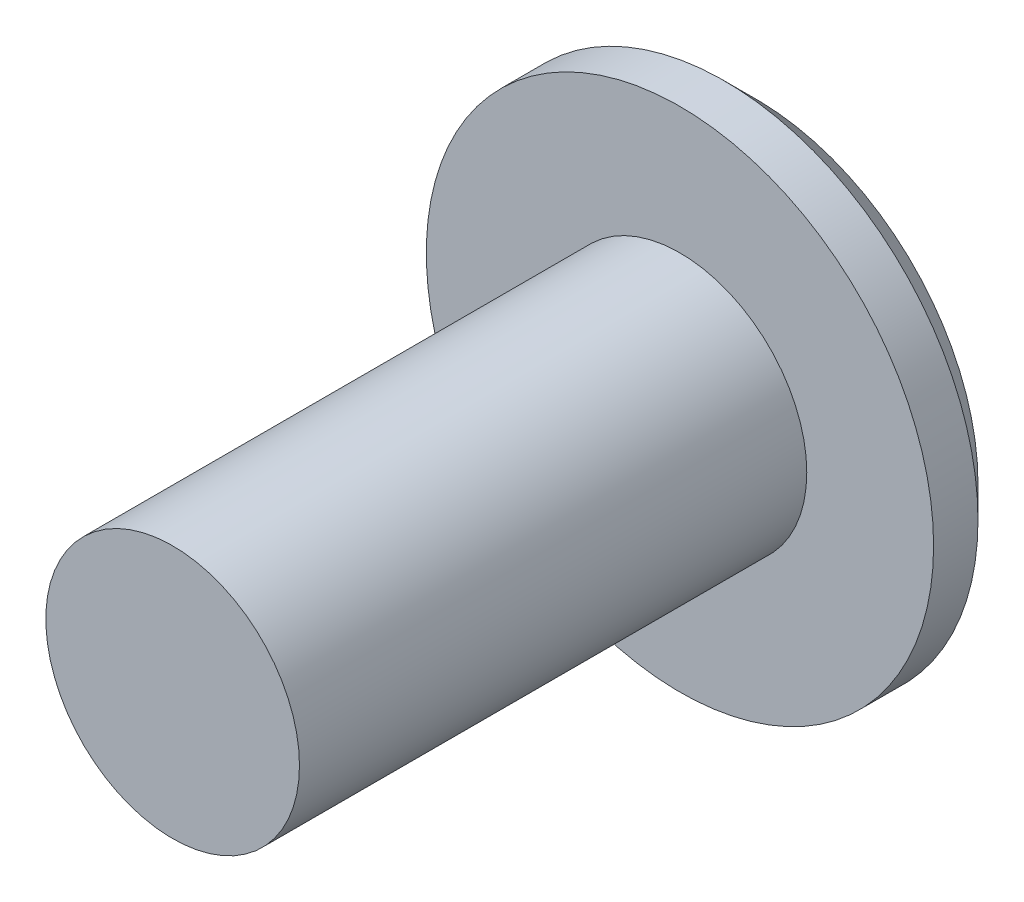
ISO-10303-21;
HEADER;
FILE_DESCRIPTION(('STEP AP214'),'2;1');
FILE_NAME('part.step','',(''),(''),'','','');
FILE_SCHEMA(('AUTOMOTIVE_DESIGN { 1 0 10303 214 1 1 1 1 }'));
ENDSEC;
DATA;
#1=APPLICATION_CONTEXT('core data for automotive mechanical design processes');
#2=APPLICATION_PROTOCOL_DEFINITION('international standard','automotive_design',2000,#1);
#3=PRODUCT_CONTEXT('',#1,'mechanical');
#4=PRODUCT('Part','Part','',(#3));
#5=PRODUCT_RELATED_PRODUCT_CATEGORY('part','',(#4));
#6=PRODUCT_DEFINITION_FORMATION('','',#4);
#7=PRODUCT_DEFINITION_CONTEXT('part definition',#1,'design');
#8=PRODUCT_DEFINITION('design','',#6,#7);
#9=PRODUCT_DEFINITION_SHAPE('','',#8);
#10=(LENGTH_UNIT() NAMED_UNIT(*) SI_UNIT(.MILLI.,.METRE.));
#11=(NAMED_UNIT(*) PLANE_ANGLE_UNIT() SI_UNIT($,.RADIAN.));
#12=(NAMED_UNIT(*) SI_UNIT($,.STERADIAN.) SOLID_ANGLE_UNIT());
#13=UNCERTAINTY_MEASURE_WITH_UNIT(LENGTH_MEASURE(1.E-05),#10,'distance_accuracy_value','');
#14=(GEOMETRIC_REPRESENTATION_CONTEXT(3) GLOBAL_UNCERTAINTY_ASSIGNED_CONTEXT((#13)) GLOBAL_UNIT_ASSIGNED_CONTEXT((#10,
#11,#12)) REPRESENTATION_CONTEXT('',''));
#15=CARTESIAN_POINT('',(0.,0.,0.));
#16=DIRECTION('',(0.,0.,1.));
#17=DIRECTION('',(1.,0.,0.));
#18=AXIS2_PLACEMENT_3D('',#15,#16,#17);
#19=CARTESIAN_POINT('',(0.,0.,1.2));
#20=DIRECTION('',(0.,0.,-1.));
#21=DIRECTION('',(-1.,0.,0.));
#22=AXIS2_PLACEMENT_3D('',#19,#20,#21);
#23=CYLINDRICAL_SURFACE('',#22,4.);
#24=CARTESIAN_POINT('',(0.,0.,0.500000000000001));
#25=DIRECTION('',(0.,0.,1.));
#26=DIRECTION('',(1.,0.,0.));
#27=AXIS2_PLACEMENT_3D('',#24,#25,#26);
#28=CIRCLE('',#27,4.);
#29=CARTESIAN_POINT('',(4.,0.,0.500000000000001));
#30=VERTEX_POINT('',#29);
#31=EDGE_CURVE('E151',#30,#30,#28,.T.);
#32=ORIENTED_EDGE('',*,*,#31,.T.);
#33=EDGE_LOOP('',(#32));
#34=FACE_BOUND('',#33,.T.);
#35=CARTESIAN_POINT('',(0.,0.,1.2));
#36=DIRECTION('',(0.,0.,1.));
#37=DIRECTION('',(1.,0.,0.));
#38=AXIS2_PLACEMENT_3D('',#35,#36,#37);
#39=CIRCLE('',#38,4.);
#40=CARTESIAN_POINT('',(4.,0.,1.2));
#41=VERTEX_POINT('',#40);
#42=EDGE_CURVE('E148',#41,#41,#39,.T.);
#43=ORIENTED_EDGE('',*,*,#42,.F.);
#44=EDGE_LOOP('',(#43));
#45=FACE_BOUND('',#44,.T.);
#46=ADVANCED_FACE('F37',(#34,#45),#23,.T.);
#47=CARTESIAN_POINT('',(0.,0.,1.2));
#48=DIRECTION('',(0.,0.,1.));
#49=DIRECTION('',(1.,0.,0.));
#50=AXIS2_PLACEMENT_3D('',#47,#48,#49);
#51=PLANE('',#50);
#52=CARTESIAN_POINT('',(0.,0.,1.2));
#53=DIRECTION('',(0.,0.,1.));
#54=DIRECTION('',(1.,0.,0.));
#55=AXIS2_PLACEMENT_3D('',#52,#53,#54);
#56=CIRCLE('',#55,2.);
#57=CARTESIAN_POINT('',(2.,0.,1.2));
#58=VERTEX_POINT('',#57);
#59=EDGE_CURVE('E11',#58,#58,#56,.T.);
#60=ORIENTED_EDGE('',*,*,#59,.F.);
#61=EDGE_LOOP('',(#60));
#62=FACE_BOUND('',#61,.T.);
#63=ORIENTED_EDGE('',*,*,#42,.T.);
#64=EDGE_LOOP('',(#63));
#65=FACE_BOUND('',#64,.T.);
#66=ADVANCED_FACE('F170',(#62,#65),#51,.T.);
#67=CARTESIAN_POINT('',(0.,0.,0.));
#68=DIRECTION('',(0.,0.,1.));
#69=DIRECTION('',(1.,0.,0.));
#70=AXIS2_PLACEMENT_3D('',#67,#68,#69);
#71=PLANE('',#70);
#72=DIRECTION('',(0.866025403784439,-0.5,0.));
#73=VECTOR('',#72,1.);
#74=CARTESIAN_POINT('',(0.,1.44337567297406,0.));
#75=LINE('',#74,#73);
#76=CARTESIAN_POINT('',(0.,1.44337567297406,0.));
#77=VERTEX_POINT('',#76);
#78=CARTESIAN_POINT('',(1.25,0.721687836487033,0.));
#79=VERTEX_POINT('',#78);
#80=EDGE_CURVE('E128',#77,#79,#75,.T.);
#81=ORIENTED_EDGE('',*,*,#80,.F.);
#82=DIRECTION('',(0.866025403784439,0.5,0.));
#83=VECTOR('',#82,1.);
#84=CARTESIAN_POINT('',(-1.25,0.721687836487033,0.));
#85=LINE('',#84,#83);
#86=CARTESIAN_POINT('',(-1.25,0.721687836487033,0.));
#87=VERTEX_POINT('',#86);
#88=EDGE_CURVE('E54',#87,#77,#85,.T.);
#89=ORIENTED_EDGE('',*,*,#88,.F.);
#90=DIRECTION('',(0.,1.,0.));
#91=VECTOR('',#90,1.);
#92=CARTESIAN_POINT('',(-1.25,-0.721687836487033,0.));
#93=LINE('',#92,#91);
#94=CARTESIAN_POINT('',(-1.25,-0.721687836487033,0.));
#95=VERTEX_POINT('',#94);
#96=EDGE_CURVE('E137',#95,#87,#93,.T.);
#97=ORIENTED_EDGE('',*,*,#96,.F.);
#98=DIRECTION('',(-0.866025403784439,0.5,0.));
#99=VECTOR('',#98,1.);
#100=CARTESIAN_POINT('',(0.,-1.44337567297406,0.));
#101=LINE('',#100,#99);
#102=CARTESIAN_POINT('',(0.,-1.44337567297406,0.));
#103=VERTEX_POINT('',#102);
#104=EDGE_CURVE('E135',#103,#95,#101,.T.);
#105=ORIENTED_EDGE('',*,*,#104,.F.);
#106=DIRECTION('',(-0.866025403784439,-0.5,0.));
#107=VECTOR('',#106,1.);
#108=CARTESIAN_POINT('',(1.25,-0.721687836487032,0.));
#109=LINE('',#108,#107);
#110=CARTESIAN_POINT('',(1.25,-0.721687836487032,0.));
#111=VERTEX_POINT('',#110);
#112=EDGE_CURVE('E102',#111,#103,#109,.T.);
#113=ORIENTED_EDGE('',*,*,#112,.F.);
#114=DIRECTION('',(0.,-1.,0.));
#115=VECTOR('',#114,1.);
#116=CARTESIAN_POINT('',(1.25,0.721687836487033,0.));
#117=LINE('',#116,#115);
#118=EDGE_CURVE('E131',#79,#111,#117,.T.);
#119=ORIENTED_EDGE('',*,*,#118,.F.);
#120=EDGE_LOOP('',(#81,#89,#97,#105,#113,#119));
#121=FACE_BOUND('',#120,.T.);
#122=CARTESIAN_POINT('',(0.,0.,0.));
#123=DIRECTION('',(0.,0.,1.));
#124=DIRECTION('',(1.,0.,0.));
#125=AXIS2_PLACEMENT_3D('',#122,#123,#124);
#126=CIRCLE('',#125,3.5);
#127=CARTESIAN_POINT('',(3.5,0.,0.));
#128=VERTEX_POINT('',#127);
#129=EDGE_CURVE('E42',#128,#128,#126,.F.);
#130=ORIENTED_EDGE('',*,*,#129,.T.);
#131=EDGE_LOOP('',(#130));
#132=FACE_BOUND('',#131,.T.);
#133=ADVANCED_FACE('F158',(#121,#132),#71,.F.);
#134=CARTESIAN_POINT('',(0.,0.,0.500000000000001));
#135=DIRECTION('',(0.,0.,1.));
#136=DIRECTION('',(1.,0.,0.));
#137=AXIS2_PLACEMENT_3D('',#134,#135,#136);
#138=CONICAL_SURFACE('',#137,4.,0.78539816339745);
#139=ORIENTED_EDGE('',*,*,#129,.F.);
#140=EDGE_LOOP('',(#139));
#141=FACE_BOUND('',#140,.T.);
#142=ORIENTED_EDGE('',*,*,#31,.F.);
#143=EDGE_LOOP('',(#142));
#144=FACE_BOUND('',#143,.T.);
#145=ADVANCED_FACE('F40',(#141,#144),#138,.T.);
#146=CARTESIAN_POINT('',(0.,0.,9.2));
#147=DIRECTION('',(0.,0.,-1.));
#148=DIRECTION('',(-1.,0.,0.));
#149=AXIS2_PLACEMENT_3D('',#146,#147,#148);
#150=CYLINDRICAL_SURFACE('',#149,2.);
#151=CARTESIAN_POINT('',(0.,0.,9.2));
#152=DIRECTION('',(0.,0.,1.));
#153=DIRECTION('',(1.,0.,0.));
#154=AXIS2_PLACEMENT_3D('',#151,#152,#153);
#155=CIRCLE('',#154,2.);
#156=CARTESIAN_POINT('',(2.,0.,9.2));
#157=VERTEX_POINT('',#156);
#158=EDGE_CURVE('E141',#157,#157,#155,.T.);
#159=ORIENTED_EDGE('',*,*,#158,.F.);
#160=EDGE_LOOP('',(#159));
#161=FACE_BOUND('',#160,.T.);
#162=ORIENTED_EDGE('',*,*,#59,.T.);
#163=EDGE_LOOP('',(#162));
#164=FACE_BOUND('',#163,.T.);
#165=ADVANCED_FACE('F162',(#161,#164),#150,.T.);
#166=CARTESIAN_POINT('',(0.,0.,9.2));
#167=DIRECTION('',(0.,0.,1.));
#168=DIRECTION('',(1.,0.,0.));
#169=AXIS2_PLACEMENT_3D('',#166,#167,#168);
#170=PLANE('',#169);
#171=ORIENTED_EDGE('',*,*,#158,.T.);
#172=EDGE_LOOP('',(#171));
#173=FACE_BOUND('',#172,.T.);
#174=ADVANCED_FACE('F167',(#173),#170,.T.);
#175=CARTESIAN_POINT('',(-1.25,0.721687836487033,2.2));
#176=DIRECTION('',(-0.5,0.866025403784439,0.));
#177=DIRECTION('',(-0.866025403784439,-0.5,0.));
#178=AXIS2_PLACEMENT_3D('',#175,#176,#177);
#179=PLANE('',#178);
#180=ORIENTED_EDGE('',*,*,#88,.T.);
#181=DIRECTION('',(0.,0.,-1.));
#182=VECTOR('',#181,1.);
#183=CARTESIAN_POINT('',(0.,1.44337567297406,2.2));
#184=LINE('',#183,#182);
#185=CARTESIAN_POINT('',(0.,1.44337567297406,2.2));
#186=VERTEX_POINT('',#185);
#187=EDGE_CURVE('E84',#186,#77,#184,.T.);
#188=ORIENTED_EDGE('',*,*,#187,.F.);
#189=DIRECTION('',(0.866025403784439,0.5,0.));
#190=VECTOR('',#189,1.);
#191=CARTESIAN_POINT('',(-1.25,0.721687836487033,2.2));
#192=LINE('',#191,#190);
#193=CARTESIAN_POINT('',(-1.25,0.721687836487033,2.2));
#194=VERTEX_POINT('',#193);
#195=EDGE_CURVE('E139',#194,#186,#192,.T.);
#196=ORIENTED_EDGE('',*,*,#195,.F.);
#197=DIRECTION('',(0.,0.,-1.));
#198=VECTOR('',#197,1.);
#199=CARTESIAN_POINT('',(-1.25,0.721687836487033,2.2));
#200=LINE('',#199,#198);
#201=EDGE_CURVE('E62',#194,#87,#200,.T.);
#202=ORIENTED_EDGE('',*,*,#201,.T.);
#203=EDGE_LOOP('',(#180,#188,#196,#202));
#204=FACE_BOUND('',#203,.T.);
#205=ADVANCED_FACE('F183',(#204),#179,.F.);
#206=CARTESIAN_POINT('',(-1.25,-0.721687836487033,2.2));
#207=DIRECTION('',(-1.,0.,0.));
#208=DIRECTION('',(0.,-1.,0.));
#209=AXIS2_PLACEMENT_3D('',#206,#207,#208);
#210=PLANE('',#209);
#211=ORIENTED_EDGE('',*,*,#96,.T.);
#212=ORIENTED_EDGE('',*,*,#201,.F.);
#213=DIRECTION('',(0.,1.,0.));
#214=VECTOR('',#213,1.);
#215=CARTESIAN_POINT('',(-1.25,-0.721687836487033,2.2));
#216=LINE('',#215,#214);
#217=CARTESIAN_POINT('',(-1.25,-0.721687836487033,2.2));
#218=VERTEX_POINT('',#217);
#219=EDGE_CURVE('E114',#218,#194,#216,.T.);
#220=ORIENTED_EDGE('',*,*,#219,.F.);
#221=DIRECTION('',(0.,0.,-1.));
#222=VECTOR('',#221,1.);
#223=CARTESIAN_POINT('',(-1.25,-0.721687836487033,2.2));
#224=LINE('',#223,#222);
#225=EDGE_CURVE('E106',#218,#95,#224,.T.);
#226=ORIENTED_EDGE('',*,*,#225,.T.);
#227=EDGE_LOOP('',(#211,#212,#220,#226));
#228=FACE_BOUND('',#227,.T.);
#229=ADVANCED_FACE('F187',(#228),#210,.F.);
#230=CARTESIAN_POINT('',(0.,-1.44337567297406,2.2));
#231=DIRECTION('',(-0.5,-0.866025403784439,0.));
#232=DIRECTION('',(0.866025403784439,-0.5,0.));
#233=AXIS2_PLACEMENT_3D('',#230,#231,#232);
#234=PLANE('',#233);
#235=ORIENTED_EDGE('',*,*,#104,.T.);
#236=ORIENTED_EDGE('',*,*,#225,.F.);
#237=DIRECTION('',(-0.866025403784439,0.5,0.));
#238=VECTOR('',#237,1.);
#239=CARTESIAN_POINT('',(0.,-1.44337567297406,2.2));
#240=LINE('',#239,#238);
#241=CARTESIAN_POINT('',(0.,-1.44337567297406,2.2));
#242=VERTEX_POINT('',#241);
#243=EDGE_CURVE('E110',#242,#218,#240,.T.);
#244=ORIENTED_EDGE('',*,*,#243,.F.);
#245=DIRECTION('',(0.,0.,-1.));
#246=VECTOR('',#245,1.);
#247=CARTESIAN_POINT('',(0.,-1.44337567297406,2.2));
#248=LINE('',#247,#246);
#249=EDGE_CURVE('E95',#242,#103,#248,.T.);
#250=ORIENTED_EDGE('',*,*,#249,.T.);
#251=EDGE_LOOP('',(#235,#236,#244,#250));
#252=FACE_BOUND('',#251,.T.);
#253=ADVANCED_FACE('F111',(#252),#234,.F.);
#254=CARTESIAN_POINT('',(1.25,-0.721687836487032,2.2));
#255=DIRECTION('',(0.5,-0.866025403784439,0.));
#256=DIRECTION('',(0.866025403784439,0.5,0.));
#257=AXIS2_PLACEMENT_3D('',#254,#255,#256);
#258=PLANE('',#257);
#259=ORIENTED_EDGE('',*,*,#112,.T.);
#260=ORIENTED_EDGE('',*,*,#249,.F.);
#261=DIRECTION('',(-0.866025403784439,-0.5,0.));
#262=VECTOR('',#261,1.);
#263=CARTESIAN_POINT('',(1.25,-0.721687836487032,2.2));
#264=LINE('',#263,#262);
#265=CARTESIAN_POINT('',(1.25,-0.721687836487032,2.2));
#266=VERTEX_POINT('',#265);
#267=EDGE_CURVE('E99',#266,#242,#264,.T.);
#268=ORIENTED_EDGE('',*,*,#267,.F.);
#269=DIRECTION('',(0.,0.,-1.));
#270=VECTOR('',#269,1.);
#271=CARTESIAN_POINT('',(1.25,-0.721687836487032,2.2));
#272=LINE('',#271,#270);
#273=EDGE_CURVE('E107',#266,#111,#272,.T.);
#274=ORIENTED_EDGE('',*,*,#273,.T.);
#275=EDGE_LOOP('',(#259,#260,#268,#274));
#276=FACE_BOUND('',#275,.T.);
#277=ADVANCED_FACE('F97',(#276),#258,.F.);
#278=CARTESIAN_POINT('',(1.25,0.721687836487033,2.2));
#279=DIRECTION('',(1.,0.,0.));
#280=DIRECTION('',(0.,1.,0.));
#281=AXIS2_PLACEMENT_3D('',#278,#279,#280);
#282=PLANE('',#281);
#283=ORIENTED_EDGE('',*,*,#118,.T.);
#284=ORIENTED_EDGE('',*,*,#273,.F.);
#285=DIRECTION('',(0.,-1.,0.));
#286=VECTOR('',#285,1.);
#287=CARTESIAN_POINT('',(1.25,0.721687836487033,2.2));
#288=LINE('',#287,#286);
#289=CARTESIAN_POINT('',(1.25,0.721687836487033,2.2));
#290=VERTEX_POINT('',#289);
#291=EDGE_CURVE('E120',#290,#266,#288,.T.);
#292=ORIENTED_EDGE('',*,*,#291,.F.);
#293=DIRECTION('',(0.,0.,-1.));
#294=VECTOR('',#293,1.);
#295=CARTESIAN_POINT('',(1.25,0.721687836487033,2.2));
#296=LINE('',#295,#294);
#297=EDGE_CURVE('E144',#290,#79,#296,.T.);
#298=ORIENTED_EDGE('',*,*,#297,.T.);
#299=EDGE_LOOP('',(#283,#284,#292,#298));
#300=FACE_BOUND('',#299,.T.);
#301=ADVANCED_FACE('F191',(#300),#282,.F.);
#302=CARTESIAN_POINT('',(0.,1.44337567297406,2.2));
#303=DIRECTION('',(0.5,0.866025403784439,0.));
#304=DIRECTION('',(-0.866025403784439,0.5,0.));
#305=AXIS2_PLACEMENT_3D('',#302,#303,#304);
#306=PLANE('',#305);
#307=ORIENTED_EDGE('',*,*,#80,.T.);
#308=ORIENTED_EDGE('',*,*,#297,.F.);
#309=DIRECTION('',(0.866025403784439,-0.5,0.));
#310=VECTOR('',#309,1.);
#311=CARTESIAN_POINT('',(0.,1.44337567297406,2.2));
#312=LINE('',#311,#310);
#313=EDGE_CURVE('E122',#186,#290,#312,.T.);
#314=ORIENTED_EDGE('',*,*,#313,.F.);
#315=ORIENTED_EDGE('',*,*,#187,.T.);
#316=EDGE_LOOP('',(#307,#308,#314,#315));
#317=FACE_BOUND('',#316,.T.);
#318=ADVANCED_FACE('F188',(#317),#306,.F.);
#319=CARTESIAN_POINT('',(0.,0.,2.2));
#320=DIRECTION('',(0.,0.,-1.));
#321=DIRECTION('',(-1.,0.,0.));
#322=AXIS2_PLACEMENT_3D('',#319,#320,#321);
#323=PLANE('',#322);
#324=ORIENTED_EDGE('',*,*,#195,.T.);
#325=ORIENTED_EDGE('',*,*,#313,.T.);
#326=ORIENTED_EDGE('',*,*,#291,.T.);
#327=ORIENTED_EDGE('',*,*,#267,.T.);
#328=ORIENTED_EDGE('',*,*,#243,.T.);
#329=ORIENTED_EDGE('',*,*,#219,.T.);
#330=EDGE_LOOP('',(#324,#325,#326,#327,#328,#329));
#331=FACE_BOUND('',#330,.T.);
#332=ADVANCED_FACE('F117',(#331),#323,.T.);
#333=CLOSED_SHELL('',(#46,#66,#133,#145,#165,#174,#205,#229,#253,#277,#301,#318,#332));
#334=MANIFOLD_SOLID_BREP('B2',#333);
#335=ADVANCED_BREP_SHAPE_REPRESENTATION('',(#18,#334),#14);
#336=SHAPE_DEFINITION_REPRESENTATION(#9,#335);
ENDSEC;
END-ISO-10303-21;
